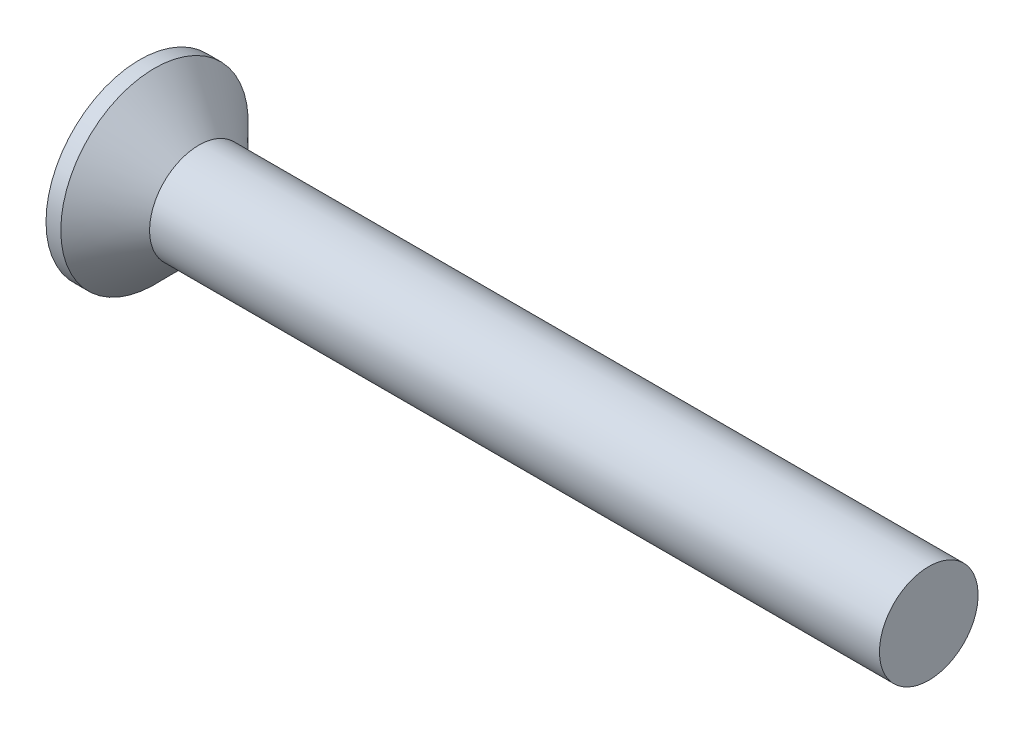
ISO-10303-21;
HEADER;
FILE_DESCRIPTION(('STEP AP214'),'2;1');
FILE_NAME('part.step','',(''),(''),'','','');
FILE_SCHEMA(('AUTOMOTIVE_DESIGN { 1 0 10303 214 1 1 1 1 }'));
ENDSEC;
DATA;
#1=APPLICATION_CONTEXT('core data for automotive mechanical design processes');
#2=APPLICATION_PROTOCOL_DEFINITION('international standard','automotive_design',2000,#1);
#3=PRODUCT_CONTEXT('',#1,'mechanical');
#4=PRODUCT('Part','Part','',(#3));
#5=PRODUCT_RELATED_PRODUCT_CATEGORY('part','',(#4));
#6=PRODUCT_DEFINITION_FORMATION('','',#4);
#7=PRODUCT_DEFINITION_CONTEXT('part definition',#1,'design');
#8=PRODUCT_DEFINITION('design','',#6,#7);
#9=PRODUCT_DEFINITION_SHAPE('','',#8);
#10=(LENGTH_UNIT() NAMED_UNIT(*) SI_UNIT(.MILLI.,.METRE.));
#11=(NAMED_UNIT(*) PLANE_ANGLE_UNIT() SI_UNIT($,.RADIAN.));
#12=(NAMED_UNIT(*) SI_UNIT($,.STERADIAN.) SOLID_ANGLE_UNIT());
#13=UNCERTAINTY_MEASURE_WITH_UNIT(LENGTH_MEASURE(1.E-05),#10,'distance_accuracy_value','');
#14=(GEOMETRIC_REPRESENTATION_CONTEXT(3) GLOBAL_UNCERTAINTY_ASSIGNED_CONTEXT((#13)) GLOBAL_UNIT_ASSIGNED_CONTEXT((#10,
#11,#12)) REPRESENTATION_CONTEXT('',''));
#15=CARTESIAN_POINT('',(0.,0.,0.));
#16=DIRECTION('',(0.,0.,1.));
#17=DIRECTION('',(1.,0.,0.));
#18=AXIS2_PLACEMENT_3D('',#15,#16,#17);
#19=CARTESIAN_POINT('',(0.,0.,0.));
#20=DIRECTION('',(-1.,0.,0.));
#21=DIRECTION('',(0.,0.,1.));
#22=AXIS2_PLACEMENT_3D('',#19,#20,#21);
#23=PLANE('',#22);
#24=CARTESIAN_POINT('',(0.,0.,0.));
#25=DIRECTION('',(-1.,0.,0.));
#26=DIRECTION('',(0.,0.,1.));
#27=AXIS2_PLACEMENT_3D('',#24,#25,#26);
#28=CIRCLE('',#27,1.9);
#29=CARTESIAN_POINT('',(0.,0.,1.9));
#30=VERTEX_POINT('',#29);
#31=EDGE_CURVE('E42',#30,#30,#28,.T.);
#32=ORIENTED_EDGE('',*,*,#31,.T.);
#33=EDGE_LOOP('',(#32));
#34=FACE_BOUND('',#33,.T.);
#35=DIRECTION('',(0.,1.,0.));
#36=VECTOR('',#35,1.);
#37=CARTESIAN_POINT('',(0.,-1.07,-0.264999999999999));
#38=LINE('',#37,#36);
#39=CARTESIAN_POINT('',(0.,-1.07,-0.264999999999999));
#40=VERTEX_POINT('',#39);
#41=CARTESIAN_POINT('',(0.,-0.264999999999999,-0.264999999999999));
#42=VERTEX_POINT('',#41);
#43=EDGE_CURVE('E103',#40,#42,#38,.T.);
#44=ORIENTED_EDGE('',*,*,#43,.T.);
#45=DIRECTION('',(0.,0.,-1.));
#46=VECTOR('',#45,1.);
#47=CARTESIAN_POINT('',(0.,-0.265000000000004,1.07));
#48=LINE('',#47,#46);
#49=CARTESIAN_POINT('',(0.,-0.264999999999996,-1.07));
#50=VERTEX_POINT('',#49);
#51=EDGE_CURVE('E83',#42,#50,#48,.T.);
#52=ORIENTED_EDGE('',*,*,#51,.T.);
#53=DIRECTION('',(0.,1.,0.));
#54=VECTOR('',#53,1.);
#55=CARTESIAN_POINT('',(0.,-0.264999999999996,-1.07));
#56=LINE('',#55,#54);
#57=CARTESIAN_POINT('',(0.,0.265000000000003,-1.07));
#58=VERTEX_POINT('',#57);
#59=EDGE_CURVE('E340',#50,#58,#56,.T.);
#60=ORIENTED_EDGE('',*,*,#59,.T.);
#61=DIRECTION('',(0.,0.,1.));
#62=VECTOR('',#61,1.);
#63=CARTESIAN_POINT('',(0.,0.265000000000003,-1.07));
#64=LINE('',#63,#62);
#65=CARTESIAN_POINT('',(0.,0.265,-0.264999999999999));
#66=VERTEX_POINT('',#65);
#67=EDGE_CURVE('E99',#58,#66,#64,.T.);
#68=ORIENTED_EDGE('',*,*,#67,.T.);
#69=CARTESIAN_POINT('',(0.,1.07,-0.264999999999999));
#70=VERTEX_POINT('',#69);
#71=EDGE_CURVE('E93',#66,#70,#38,.T.);
#72=ORIENTED_EDGE('',*,*,#71,.T.);
#73=DIRECTION('',(0.,0.,1.));
#74=VECTOR('',#73,1.);
#75=CARTESIAN_POINT('',(0.,1.07,-0.264999999999999));
#76=LINE('',#75,#74);
#77=CARTESIAN_POINT('',(0.,1.07,0.265));
#78=VERTEX_POINT('',#77);
#79=EDGE_CURVE('E96',#70,#78,#76,.T.);
#80=ORIENTED_EDGE('',*,*,#79,.T.);
#81=DIRECTION('',(0.,-1.,0.));
#82=VECTOR('',#81,1.);
#83=CARTESIAN_POINT('',(0.,1.07,0.265));
#84=LINE('',#83,#82);
#85=CARTESIAN_POINT('',(0.,0.264999999999998,0.265));
#86=VERTEX_POINT('',#85);
#87=EDGE_CURVE('E352',#78,#86,#84,.T.);
#88=ORIENTED_EDGE('',*,*,#87,.T.);
#89=CARTESIAN_POINT('',(0.,0.264999999999995,1.07));
#90=VERTEX_POINT('',#89);
#91=EDGE_CURVE('E335',#86,#90,#64,.T.);
#92=ORIENTED_EDGE('',*,*,#91,.T.);
#93=DIRECTION('',(0.,-1.,0.));
#94=VECTOR('',#93,1.);
#95=CARTESIAN_POINT('',(0.,0.264999999999995,1.07));
#96=LINE('',#95,#94);
#97=CARTESIAN_POINT('',(0.,-0.265000000000004,1.07));
#98=VERTEX_POINT('',#97);
#99=EDGE_CURVE('E321',#90,#98,#96,.T.);
#100=ORIENTED_EDGE('',*,*,#99,.T.);
#101=CARTESIAN_POINT('',(0.,-0.265000000000001,0.265));
#102=VERTEX_POINT('',#101);
#103=EDGE_CURVE('E333',#98,#102,#48,.T.);
#104=ORIENTED_EDGE('',*,*,#103,.T.);
#105=CARTESIAN_POINT('',(0.,-1.07,0.265));
#106=VERTEX_POINT('',#105);
#107=EDGE_CURVE('E109',#102,#106,#84,.T.);
#108=ORIENTED_EDGE('',*,*,#107,.T.);
#109=DIRECTION('',(0.,0.,-1.));
#110=VECTOR('',#109,1.);
#111=CARTESIAN_POINT('',(0.,-1.07,0.265));
#112=LINE('',#111,#110);
#113=EDGE_CURVE('E132',#106,#40,#112,.T.);
#114=ORIENTED_EDGE('',*,*,#113,.T.);
#115=EDGE_LOOP('',(#44,#52,#60,#68,#72,#80,#88,#92,#100,#104,#108,#114));
#116=FACE_BOUND('',#115,.T.);
#117=ADVANCED_FACE('F35',(#34,#116),#23,.T.);
#118=CARTESIAN_POINT('',(1.75765333333333,0.,0.113773333333333));
#119=DIRECTION('',(-0.0857222578731988,0.,-0.996319072639443));
#120=DIRECTION('',(-0.996319072639444,0.,0.0857222578731988));
#121=AXIS2_PLACEMENT_3D('',#118,#119,#120);
#122=PLANE('',#121);
#123=ORIENTED_EDGE('',*,*,#107,.F.);
#124=DIRECTION('',(0.992678495991953,0.0854090264408663,-0.0854090264408661));
#125=VECTOR('',#124,1.);
#126=CARTESIAN_POINT('',(1.76729945793969,-0.112943390794151,0.112943390794151));
#127=LINE('',#126,#125);
#128=CARTESIAN_POINT('',(1.54,-0.132500000000001,0.1325));
#129=VERTEX_POINT('',#128);
#130=EDGE_CURVE('E127',#102,#129,#127,.T.);
#131=ORIENTED_EDGE('',*,*,#130,.T.);
#132=DIRECTION('',(0.851874354386278,0.518592342361776,-0.0732943843871311));
#133=VECTOR('',#132,1.);
#134=CARTESIAN_POINT('',(0.,-1.07,0.265));
#135=LINE('',#134,#133);
#136=EDGE_CURVE('E104',#106,#129,#135,.T.);
#137=ORIENTED_EDGE('',*,*,#136,.F.);
#138=EDGE_LOOP('',(#123,#131,#137));
#139=FACE_BOUND('',#138,.T.);
#140=ADVANCED_FACE('F155',(#139),#122,.T.);
#141=DIRECTION('',(0.851874354386278,-0.518592342361776,-0.0732943843871309));
#142=VECTOR('',#141,1.);
#143=CARTESIAN_POINT('',(0.,1.07,0.265));
#144=LINE('',#143,#142);
#145=CARTESIAN_POINT('',(1.54,0.1325,0.1325));
#146=VERTEX_POINT('',#145);
#147=EDGE_CURVE('E49',#78,#146,#144,.T.);
#148=ORIENTED_EDGE('',*,*,#147,.T.);
#149=DIRECTION('',(-0.992678495991954,0.0854090264408653,0.085409026440866));
#150=VECTOR('',#149,1.);
#151=CARTESIAN_POINT('',(1.76729945793969,0.11294339079415,0.112943390794151));
#152=LINE('',#151,#150);
#153=EDGE_CURVE('E348',#146,#86,#152,.T.);
#154=ORIENTED_EDGE('',*,*,#153,.T.);
#155=ORIENTED_EDGE('',*,*,#87,.F.);
#156=EDGE_LOOP('',(#148,#154,#155));
#157=FACE_BOUND('',#156,.T.);
#158=ADVANCED_FACE('F159',(#157),#122,.T.);
#159=CARTESIAN_POINT('',(1.75765333333333,0.,-0.113773333333333));
#160=DIRECTION('',(-0.0857222578731983,0.,0.996319072639444));
#161=DIRECTION('',(0.996319072639444,0.,0.0857222578731983));
#162=AXIS2_PLACEMENT_3D('',#159,#160,#161);
#163=PLANE('',#162);
#164=DIRECTION('',(0.851874354386278,0.518592342361776,0.0732943843871306));
#165=VECTOR('',#164,1.);
#166=CARTESIAN_POINT('',(0.,-1.07,-0.264999999999999));
#167=LINE('',#166,#165);
#168=CARTESIAN_POINT('',(1.54,-0.1325,-0.132500000000001));
#169=VERTEX_POINT('',#168);
#170=EDGE_CURVE('E58',#40,#169,#167,.T.);
#171=ORIENTED_EDGE('',*,*,#170,.T.);
#172=DIRECTION('',(-0.992678495991954,-0.0854090264408658,-0.0854090264408656));
#173=VECTOR('',#172,1.);
#174=CARTESIAN_POINT('',(1.76729945793969,-0.11294339079415,-0.11294339079415));
#175=LINE('',#174,#173);
#176=EDGE_CURVE('E11',#169,#42,#175,.T.);
#177=ORIENTED_EDGE('',*,*,#176,.T.);
#178=ORIENTED_EDGE('',*,*,#43,.F.);
#179=EDGE_LOOP('',(#171,#177,#178));
#180=FACE_BOUND('',#179,.T.);
#181=ADVANCED_FACE('F152',(#180),#163,.T.);
#182=ORIENTED_EDGE('',*,*,#71,.F.);
#183=DIRECTION('',(0.992678495991953,-0.0854090264408659,0.0854090264408656));
#184=VECTOR('',#183,1.);
#185=CARTESIAN_POINT('',(1.76729945793969,0.112943390794151,-0.11294339079415));
#186=LINE('',#185,#184);
#187=CARTESIAN_POINT('',(1.54,0.1325,-0.1325));
#188=VERTEX_POINT('',#187);
#189=EDGE_CURVE('E112',#66,#188,#186,.T.);
#190=ORIENTED_EDGE('',*,*,#189,.T.);
#191=DIRECTION('',(0.851874354386278,-0.518592342361776,0.0732943843871306));
#192=VECTOR('',#191,1.);
#193=CARTESIAN_POINT('',(0.,1.07,-0.264999999999999));
#194=LINE('',#193,#192);
#195=EDGE_CURVE('E108',#70,#188,#194,.T.);
#196=ORIENTED_EDGE('',*,*,#195,.F.);
#197=EDGE_LOOP('',(#182,#190,#196));
#198=FACE_BOUND('',#197,.T.);
#199=ADVANCED_FACE('F111',(#198),#163,.T.);
#200=CARTESIAN_POINT('',(-6.34999999999999,0.,0.));
#201=DIRECTION('',(-1.,0.,0.));
#202=DIRECTION('',(0.,0.,1.));
#203=AXIS2_PLACEMENT_3D('',#200,#201,#202);
#204=CYLINDRICAL_SURFACE('',#203,1.9);
#205=CARTESIAN_POINT('',(0.300000000000004,0.,0.));
#206=DIRECTION('',(-1.,0.,0.));
#207=DIRECTION('',(0.,0.,1.));
#208=AXIS2_PLACEMENT_3D('',#205,#206,#207);
#209=CIRCLE('',#208,1.9);
#210=CARTESIAN_POINT('',(0.300000000000004,0.,1.9));
#211=VERTEX_POINT('',#210);
#212=EDGE_CURVE('E135',#211,#211,#209,.T.);
#213=ORIENTED_EDGE('',*,*,#212,.T.);
#214=EDGE_LOOP('',(#213));
#215=FACE_BOUND('',#214,.T.);
#216=ORIENTED_EDGE('',*,*,#31,.F.);
#217=EDGE_LOOP('',(#216));
#218=FACE_BOUND('',#217,.T.);
#219=ADVANCED_FACE('F141',(#215,#218),#204,.T.);
#220=CARTESIAN_POINT('',(0.300000000000004,0.,0.));
#221=DIRECTION('',(-1.,0.,0.));
#222=DIRECTION('',(0.,0.,1.));
#223=AXIS2_PLACEMENT_3D('',#220,#221,#222);
#224=CONICAL_SURFACE('',#223,1.9,0.785398163397451);
#225=CARTESIAN_POINT('',(1.2,0.,0.));
#226=DIRECTION('',(-1.,0.,0.));
#227=DIRECTION('',(0.,0.,1.));
#228=AXIS2_PLACEMENT_3D('',#225,#226,#227);
#229=CIRCLE('',#228,1.);
#230=CARTESIAN_POINT('',(1.2,0.,1.));
#231=VERTEX_POINT('',#230);
#232=EDGE_CURVE('E131',#231,#231,#229,.T.);
#233=ORIENTED_EDGE('',*,*,#232,.T.);
#234=EDGE_LOOP('',(#233));
#235=FACE_BOUND('',#234,.T.);
#236=ORIENTED_EDGE('',*,*,#212,.F.);
#237=EDGE_LOOP('',(#236));
#238=FACE_BOUND('',#237,.T.);
#239=ADVANCED_FACE('F143',(#235,#238),#224,.T.);
#240=CARTESIAN_POINT('',(-6.34999999999999,0.,0.));
#241=DIRECTION('',(-1.,0.,0.));
#242=DIRECTION('',(0.,0.,1.));
#243=AXIS2_PLACEMENT_3D('',#240,#241,#242);
#244=CYLINDRICAL_SURFACE('',#243,1.);
#245=CARTESIAN_POINT('',(16.,0.,0.));
#246=DIRECTION('',(-1.,0.,0.));
#247=DIRECTION('',(0.,0.,1.));
#248=AXIS2_PLACEMENT_3D('',#245,#246,#247);
#249=CIRCLE('',#248,1.);
#250=CARTESIAN_POINT('',(16.,0.,1.));
#251=VERTEX_POINT('',#250);
#252=EDGE_CURVE('E128',#251,#251,#249,.T.);
#253=ORIENTED_EDGE('',*,*,#252,.T.);
#254=EDGE_LOOP('',(#253));
#255=FACE_BOUND('',#254,.T.);
#256=ORIENTED_EDGE('',*,*,#232,.F.);
#257=EDGE_LOOP('',(#256));
#258=FACE_BOUND('',#257,.T.);
#259=ADVANCED_FACE('F149',(#255,#258),#244,.T.);
#260=CARTESIAN_POINT('',(16.,1.,0.));
#261=DIRECTION('',(1.,0.,0.));
#262=DIRECTION('',(0.,0.,-1.));
#263=AXIS2_PLACEMENT_3D('',#260,#261,#262);
#264=PLANE('',#263);
#265=ORIENTED_EDGE('',*,*,#252,.F.);
#266=EDGE_LOOP('',(#265));
#267=FACE_BOUND('',#266,.T.);
#268=ADVANCED_FACE('F179',(#267),#264,.T.);
#269=CARTESIAN_POINT('',(1.54,0.1325,-0.1325));
#270=DIRECTION('',(1.,0.,0.));
#271=DIRECTION('',(0.,0.,-1.));
#272=AXIS2_PLACEMENT_3D('',#269,#270,#271);
#273=PLANE('',#272);
#274=DIRECTION('',(0.,1.,0.));
#275=VECTOR('',#274,1.);
#276=CARTESIAN_POINT('',(1.54,-0.1325,-0.1325));
#277=LINE('',#276,#275);
#278=EDGE_CURVE('E123',#169,#188,#277,.T.);
#279=ORIENTED_EDGE('',*,*,#278,.F.);
#280=DIRECTION('',(0.,0.,-1.));
#281=VECTOR('',#280,1.);
#282=CARTESIAN_POINT('',(1.54,-0.1325,0.1325));
#283=LINE('',#282,#281);
#284=EDGE_CURVE('E114',#129,#169,#283,.T.);
#285=ORIENTED_EDGE('',*,*,#284,.F.);
#286=DIRECTION('',(0.,-1.,0.));
#287=VECTOR('',#286,1.);
#288=CARTESIAN_POINT('',(1.54,0.1325,0.1325));
#289=LINE('',#288,#287);
#290=EDGE_CURVE('E117',#146,#129,#289,.T.);
#291=ORIENTED_EDGE('',*,*,#290,.F.);
#292=DIRECTION('',(0.,0.,1.));
#293=VECTOR('',#292,1.);
#294=CARTESIAN_POINT('',(1.54,0.1325,-0.1325));
#295=LINE('',#294,#293);
#296=EDGE_CURVE('E121',#188,#146,#295,.T.);
#297=ORIENTED_EDGE('',*,*,#296,.F.);
#298=EDGE_LOOP('',(#279,#285,#291,#297));
#299=FACE_BOUND('',#298,.T.);
#300=ADVANCED_FACE('F176',(#299),#273,.F.);
#301=CARTESIAN_POINT('',(0.,-1.07,-0.264999999999999));
#302=DIRECTION('',(-0.519990936244092,0.854171777936963,0.));
#303=DIRECTION('',(-0.854171777936963,-0.519990936244092,0.));
#304=AXIS2_PLACEMENT_3D('',#301,#302,#303);
#305=PLANE('',#304);
#306=ORIENTED_EDGE('',*,*,#170,.F.);
#307=ORIENTED_EDGE('',*,*,#113,.F.);
#308=ORIENTED_EDGE('',*,*,#136,.T.);
#309=ORIENTED_EDGE('',*,*,#284,.T.);
#310=EDGE_LOOP('',(#306,#307,#308,#309));
#311=FACE_BOUND('',#310,.T.);
#312=ADVANCED_FACE('F168',(#311),#305,.T.);
#313=CARTESIAN_POINT('',(1.54,0.1325,0.1325));
#314=DIRECTION('',(-0.519990936244092,-0.854171777936963,0.));
#315=DIRECTION('',(0.854171777936963,-0.519990936244092,0.));
#316=AXIS2_PLACEMENT_3D('',#313,#314,#315);
#317=PLANE('',#316);
#318=ORIENTED_EDGE('',*,*,#147,.F.);
#319=ORIENTED_EDGE('',*,*,#79,.F.);
#320=ORIENTED_EDGE('',*,*,#195,.T.);
#321=ORIENTED_EDGE('',*,*,#296,.T.);
#322=EDGE_LOOP('',(#318,#319,#320,#321));
#323=FACE_BOUND('',#322,.T.);
#324=ADVANCED_FACE('F107',(#323),#317,.T.);
#325=CARTESIAN_POINT('',(1.75765333333333,-0.113773333333333,0.));
#326=DIRECTION('',(-0.0857222578731988,0.996319072639443,0.));
#327=DIRECTION('',(-0.996319072639444,-0.0857222578731988,0.));
#328=AXIS2_PLACEMENT_3D('',#325,#326,#327);
#329=PLANE('',#328);
#330=DIRECTION('',(0.851874354386278,0.0732943843871292,0.518592342361776));
#331=VECTOR('',#330,1.);
#332=CARTESIAN_POINT('',(0.,-0.264999999999996,-1.07));
#333=LINE('',#332,#331);
#334=EDGE_CURVE('E342',#50,#169,#333,.T.);
#335=ORIENTED_EDGE('',*,*,#334,.F.);
#336=ORIENTED_EDGE('',*,*,#51,.F.);
#337=ORIENTED_EDGE('',*,*,#176,.F.);
#338=EDGE_LOOP('',(#335,#336,#337));
#339=FACE_BOUND('',#338,.T.);
#340=ADVANCED_FACE('F175',(#339),#329,.T.);
#341=CARTESIAN_POINT('',(1.75765333333333,0.113773333333333,0.));
#342=DIRECTION('',(-0.0857222578731983,-0.996319072639444,0.));
#343=DIRECTION('',(0.996319072639444,-0.0857222578731983,0.));
#344=AXIS2_PLACEMENT_3D('',#341,#342,#343);
#345=PLANE('',#344);
#346=ORIENTED_EDGE('',*,*,#67,.F.);
#347=DIRECTION('',(0.851874354386278,-0.0732943843871324,0.518592342361776));
#348=VECTOR('',#347,1.);
#349=CARTESIAN_POINT('',(0.,0.265000000000003,-1.07));
#350=LINE('',#349,#348);
#351=EDGE_CURVE('E74',#58,#188,#350,.T.);
#352=ORIENTED_EDGE('',*,*,#351,.T.);
#353=ORIENTED_EDGE('',*,*,#189,.F.);
#354=EDGE_LOOP('',(#346,#352,#353));
#355=FACE_BOUND('',#354,.T.);
#356=ADVANCED_FACE('F219',(#355),#345,.T.);
#357=CARTESIAN_POINT('',(0.,0.265000000000003,-1.07));
#358=DIRECTION('',(-0.519990936244092,0.,0.854171777936963));
#359=DIRECTION('',(-0.854171777936963,0.,-0.519990936244092));
#360=AXIS2_PLACEMENT_3D('',#357,#358,#359);
#361=PLANE('',#360);
#362=ORIENTED_EDGE('',*,*,#351,.F.);
#363=ORIENTED_EDGE('',*,*,#59,.F.);
#364=ORIENTED_EDGE('',*,*,#334,.T.);
#365=ORIENTED_EDGE('',*,*,#278,.T.);
#366=EDGE_LOOP('',(#362,#363,#364,#365));
#367=FACE_BOUND('',#366,.T.);
#368=ADVANCED_FACE('F227',(#367),#361,.T.);
#369=ORIENTED_EDGE('',*,*,#103,.F.);
#370=DIRECTION('',(0.851874354386278,0.0732943843871327,-0.518592342361776));
#371=VECTOR('',#370,1.);
#372=CARTESIAN_POINT('',(0.,-0.265000000000004,1.07));
#373=LINE('',#372,#371);
#374=EDGE_CURVE('E318',#98,#129,#373,.T.);
#375=ORIENTED_EDGE('',*,*,#374,.T.);
#376=ORIENTED_EDGE('',*,*,#130,.F.);
#377=EDGE_LOOP('',(#369,#375,#376));
#378=FACE_BOUND('',#377,.T.);
#379=ADVANCED_FACE('F221',(#378),#329,.T.);
#380=DIRECTION('',(0.851874354386278,-0.0732943843871288,-0.518592342361776));
#381=VECTOR('',#380,1.);
#382=CARTESIAN_POINT('',(0.,0.264999999999995,1.07));
#383=LINE('',#382,#381);
#384=EDGE_CURVE('E329',#90,#146,#383,.T.);
#385=ORIENTED_EDGE('',*,*,#384,.F.);
#386=ORIENTED_EDGE('',*,*,#91,.F.);
#387=ORIENTED_EDGE('',*,*,#153,.F.);
#388=EDGE_LOOP('',(#385,#386,#387));
#389=FACE_BOUND('',#388,.T.);
#390=ADVANCED_FACE('F229',(#389),#345,.T.);
#391=CARTESIAN_POINT('',(1.54,-0.132500000000001,0.1325));
#392=DIRECTION('',(-0.519990936244092,0.,-0.854171777936963));
#393=DIRECTION('',(0.854171777936963,0.,-0.519990936244092));
#394=AXIS2_PLACEMENT_3D('',#391,#392,#393);
#395=PLANE('',#394);
#396=ORIENTED_EDGE('',*,*,#374,.F.);
#397=ORIENTED_EDGE('',*,*,#99,.F.);
#398=ORIENTED_EDGE('',*,*,#384,.T.);
#399=ORIENTED_EDGE('',*,*,#290,.T.);
#400=EDGE_LOOP('',(#396,#397,#398,#399));
#401=FACE_BOUND('',#400,.T.);
#402=ADVANCED_FACE('F248',(#401),#395,.T.);
#403=CLOSED_SHELL('',(#117,#140,#158,#181,#199,#219,#239,#259,#268,#300,#312,#324,#340,#356,
#368,#379,#390,#402));
#404=MANIFOLD_SOLID_BREP('B2',#403);
#405=ADVANCED_BREP_SHAPE_REPRESENTATION('',(#18,#404),#14);
#406=SHAPE_DEFINITION_REPRESENTATION(#9,#405);
ENDSEC;
END-ISO-10303-21;
